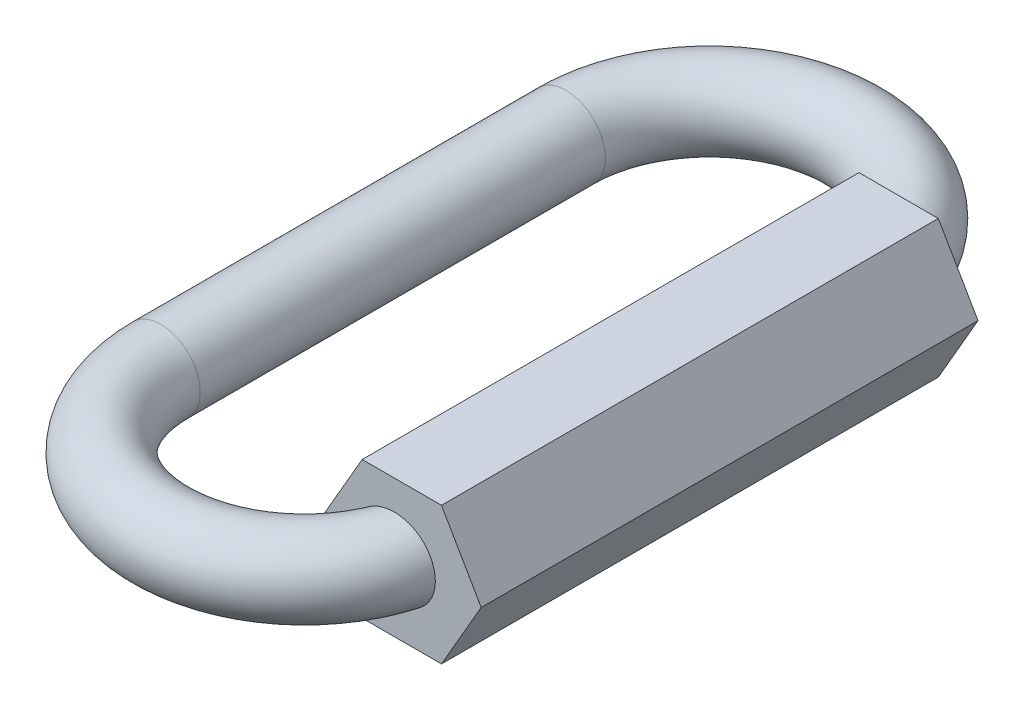
ISO-10303-21;
HEADER;
FILE_DESCRIPTION(('STEP AP214'),'2;1');
FILE_NAME('part.step','',(''),(''),'','','');
FILE_SCHEMA(('AUTOMOTIVE_DESIGN { 1 0 10303 214 1 1 1 1 }'));
ENDSEC;
DATA;
#1=APPLICATION_CONTEXT('core data for automotive mechanical design processes');
#2=APPLICATION_PROTOCOL_DEFINITION('international standard','automotive_design',2000,#1);
#3=PRODUCT_CONTEXT('',#1,'mechanical');
#4=PRODUCT('Part','Part','',(#3));
#5=PRODUCT_RELATED_PRODUCT_CATEGORY('part','',(#4));
#6=PRODUCT_DEFINITION_FORMATION('','',#4);
#7=PRODUCT_DEFINITION_CONTEXT('part definition',#1,'design');
#8=PRODUCT_DEFINITION('design','',#6,#7);
#9=PRODUCT_DEFINITION_SHAPE('','',#8);
#10=(LENGTH_UNIT() NAMED_UNIT(*) SI_UNIT(.MILLI.,.METRE.));
#11=(NAMED_UNIT(*) PLANE_ANGLE_UNIT() SI_UNIT($,.RADIAN.));
#12=(NAMED_UNIT(*) SI_UNIT($,.STERADIAN.) SOLID_ANGLE_UNIT());
#13=UNCERTAINTY_MEASURE_WITH_UNIT(LENGTH_MEASURE(1.E-05),#10,'distance_accuracy_value','');
#14=(GEOMETRIC_REPRESENTATION_CONTEXT(3) GLOBAL_UNCERTAINTY_ASSIGNED_CONTEXT((#13)) GLOBAL_UNIT_ASSIGNED_CONTEXT((#10,
#11,#12)) REPRESENTATION_CONTEXT('',''));
#15=CARTESIAN_POINT('',(0.,0.,0.));
#16=DIRECTION('',(0.,0.,1.));
#17=DIRECTION('',(1.,0.,0.));
#18=AXIS2_PLACEMENT_3D('',#15,#16,#17);
#19=CARTESIAN_POINT('',(0.,0.,-16.));
#20=DIRECTION('',(0.,0.,1.));
#21=DIRECTION('',(1.,0.,0.));
#22=AXIS2_PLACEMENT_3D('',#19,#20,#21);
#23=PLANE('',#22);
#24=DIRECTION('',(-1.,0.,0.));
#25=VECTOR('',#24,1.);
#26=CARTESIAN_POINT('',(2.5547749411641,4.425,-16.));
#27=LINE('',#26,#25);
#28=CARTESIAN_POINT('',(2.5547749411641,4.425,-16.));
#29=VERTEX_POINT('',#28);
#30=CARTESIAN_POINT('',(-2.55477494116409,4.425,-16.));
#31=VERTEX_POINT('',#30);
#32=EDGE_CURVE('E106',#29,#31,#27,.T.);
#33=ORIENTED_EDGE('',*,*,#32,.F.);
#34=DIRECTION('',(-0.5,0.866025403784439,0.));
#35=VECTOR('',#34,1.);
#36=CARTESIAN_POINT('',(5.10954988232819,0.,-16.));
#37=LINE('',#36,#35);
#38=CARTESIAN_POINT('',(5.10954988232819,0.,-16.));
#39=VERTEX_POINT('',#38);
#40=EDGE_CURVE('E111',#39,#29,#37,.T.);
#41=ORIENTED_EDGE('',*,*,#40,.F.);
#42=DIRECTION('',(0.5,0.866025403784439,0.));
#43=VECTOR('',#42,1.);
#44=CARTESIAN_POINT('',(2.55477494116409,-4.425,-16.));
#45=LINE('',#44,#43);
#46=CARTESIAN_POINT('',(2.55477494116409,-4.425,-16.));
#47=VERTEX_POINT('',#46);
#48=EDGE_CURVE('E144',#47,#39,#45,.T.);
#49=ORIENTED_EDGE('',*,*,#48,.F.);
#50=DIRECTION('',(1.,0.,0.));
#51=VECTOR('',#50,1.);
#52=CARTESIAN_POINT('',(-2.5547749411641,-4.425,-16.));
#53=LINE('',#52,#51);
#54=CARTESIAN_POINT('',(-2.5547749411641,-4.425,-16.));
#55=VERTEX_POINT('',#54);
#56=EDGE_CURVE('E141',#55,#47,#53,.T.);
#57=ORIENTED_EDGE('',*,*,#56,.F.);
#58=DIRECTION('',(0.5,-0.866025403784439,0.));
#59=VECTOR('',#58,1.);
#60=CARTESIAN_POINT('',(-5.10954988232819,0.,-16.));
#61=LINE('',#60,#59);
#62=CARTESIAN_POINT('',(-5.10954988232819,0.,-16.));
#63=VERTEX_POINT('',#62);
#64=EDGE_CURVE('E138',#63,#55,#61,.T.);
#65=ORIENTED_EDGE('',*,*,#64,.F.);
#66=DIRECTION('',(-0.5,-0.866025403784439,0.));
#67=VECTOR('',#66,1.);
#68=CARTESIAN_POINT('',(-2.55477494116409,4.425,-16.));
#69=LINE('',#68,#67);
#70=EDGE_CURVE('E136',#31,#63,#69,.T.);
#71=ORIENTED_EDGE('',*,*,#70,.F.);
#72=EDGE_LOOP('',(#33,#41,#49,#57,#65,#71));
#73=FACE_BOUND('',#72,.T.);
#74=CARTESIAN_POINT('',(-3.06900413536494,-0.801609790145161,-16.));
#75=CARTESIAN_POINT('',(-3.01909351343685,-0.936363503355609,-16.));
#76=CARTESIAN_POINT('',(-2.95688127019971,-1.06673171723537,-16.));
#77=CARTESIAN_POINT('',(-2.81090149906449,-1.31498422112775,-16.));
#78=CARTESIAN_POINT('',(-2.72708325250222,-1.4328382030191,-16.));
#79=CARTESIAN_POINT('',(-2.54172024753748,-1.65272885793883,-16.));
#80=CARTESIAN_POINT('',(-2.44025489208379,-1.7548326722037,-16.));
#81=CARTESIAN_POINT('',(-2.22267898122295,-1.9418401468518,-16.));
#82=CARTESIAN_POINT('',(-2.10657342130815,-2.0267496486009,-16.));
#83=CARTESIAN_POINT('',(-1.85451503240919,-2.18305460665647,-16.));
#84=CARTESIAN_POINT('',(-1.71774998530612,-2.25314171050424,-16.));
#85=CARTESIAN_POINT('',(-1.43474640324376,-2.37055087342658,-16.));
#86=CARTESIAN_POINT('',(-1.28850452355718,-2.41786484481509,-16.));
#87=CARTESIAN_POINT('',(-0.983433431555195,-2.49014638260548,-16.));
#88=CARTESIAN_POINT('',(-0.824334720861344,-2.51398373731019,-16.));
#89=CARTESIAN_POINT('',(-0.504376810758348,-2.53446285675912,-16.));
#90=CARTESIAN_POINT('',(-0.343517567407138,-2.53110394114424,-16.));
#91=CARTESIAN_POINT('',(-0.0256618986446927,-2.49690259408987,-16.));
#92=CARTESIAN_POINT('',(0.13135151117211,-2.46621956108199,-16.));
#93=CARTESIAN_POINT('',(0.43762553258376,-2.37790755269611,-16.));
#94=CARTESIAN_POINT('',(0.586887619389329,-2.32028372565304,-16.));
#95=CARTESIAN_POINT('',(0.867448038032218,-2.18190150489549,-16.));
#96=CARTESIAN_POINT('',(0.999206264996456,-2.10207630039365,-16.));
#97=CARTESIAN_POINT('',(1.24662791439162,-1.92047933347772,-16.));
#98=CARTESIAN_POINT('',(1.36229542792527,-1.81871316644663,-16.));
#99=CARTESIAN_POINT('',(1.56884744521657,-1.60097771795354,-16.));
#100=CARTESIAN_POINT('',(1.66059811984797,-1.48582983916977,-16.));
#101=CARTESIAN_POINT('',(1.82260751569294,-1.24129153891539,-16.));
#102=CARTESIAN_POINT('',(1.89287102219418,-1.11190429735538,-16.));
#103=CARTESIAN_POINT('',(2.00735863427976,-0.84758468646424,-16.));
#104=CARTESIAN_POINT('',(2.05242497109594,-0.713016712173273,-16.));
#105=CARTESIAN_POINT('',(2.11878380012589,-0.438143557109762,-16.));
#106=CARTESIAN_POINT('',(2.14007963109195,-0.297839184929372,-16.));
#107=CARTESIAN_POINT('',(2.1579874983122,-0.0186200287027689,-16.));
#108=CARTESIAN_POINT('',(2.15510609574921,0.120262516628913,-16.));
#109=CARTESIAN_POINT('',(2.12596290955776,0.39554573220375,-16.));
#110=CARTESIAN_POINT('',(2.09970230566197,0.531946527323558,-16.));
#111=CARTESIAN_POINT('',(2.02480932622923,0.797869644837646,-16.));
#112=CARTESIAN_POINT('',(1.97626538227519,0.927416919914012,-16.));
#113=CARTESIAN_POINT('',(1.85838271452179,1.17666533177516,-16.));
#114=CARTESIAN_POINT('',(1.78904327357627,1.29636612881634,-16.));
#115=CARTESIAN_POINT('',(1.6306991626606,1.52424289065856,-16.));
#116=CARTESIAN_POINT('',(1.54145374926007,1.63225140846116,-16.));
#117=CARTESIAN_POINT('',(1.34654188050046,1.83224756018794,-16.));
#118=CARTESIAN_POINT('',(1.24087364848552,1.92423345846465,-16.));
#119=CARTESIAN_POINT('',(1.01303904293868,2.09238300156938,-16.));
#120=CARTESIAN_POINT('',(0.890495312656878,2.16803496175709,-16.));
#121=CARTESIAN_POINT('',(0.634819636473529,2.29857405412186,-16.));
#122=CARTESIAN_POINT('',(0.501685896736691,2.35345765925634,-16.));
#123=CARTESIAN_POINT('',(0.223088141399425,2.44321661026248,-16.));
#124=CARTESIAN_POINT('',(0.0773456622172722,2.47722716406105,-16.));
#125=CARTESIAN_POINT('',(-0.217704025009056,2.52138476989456,-16.));
#126=CARTESIAN_POINT('',(-0.367011980050677,2.53152677616294,-16.));
#127=CARTESIAN_POINT('',(-0.671692423394591,2.5280294175261,-16.));
#128=CARTESIAN_POINT('',(-0.827053352685859,2.51336246200072,-16.));
#129=CARTESIAN_POINT('',(-1.1333365329374,2.45896976739161,-16.));
#130=CARTESIAN_POINT('',(-1.2842577896496,2.41923845928562,-16.));
#131=CARTESIAN_POINT('',(-1.58214223485238,2.31425364020075,-16.));
#132=CARTESIAN_POINT('',(-1.72884583971759,2.248261354253,-16.));
#133=CARTESIAN_POINT('',(-2.00905174382948,2.09243263323473,-16.));
#134=CARTESIAN_POINT('',(-2.14255195654584,2.00259243772001,-16.));
#135=CARTESIAN_POINT('',(-2.3910919911656,1.80179932011212,-16.));
#136=CARTESIAN_POINT('',(-2.50625662505924,1.69100146668601,-16.));
#137=CARTESIAN_POINT('',(-2.71477547732237,1.450453264465,-16.));
#138=CARTESIAN_POINT('',(-2.80813970933333,1.32071166184475,-16.));
#139=CARTESIAN_POINT('',(-2.96323209320142,1.05491478733935,-16.));
#140=CARTESIAN_POINT('',(-3.02664523929416,0.919845880975425,-16.));
#141=CARTESIAN_POINT('',(-3.12711357895555,0.640201851585324,-16.));
#142=CARTESIAN_POINT('',(-3.16418352473017,0.495632098674113,-16.));
#143=CARTESIAN_POINT('',(-3.20748446000285,0.216187216321993,-16.));
#144=CARTESIAN_POINT('',(-3.21633204571152,0.0817120028597768,-16.));
#145=CARTESIAN_POINT('',(-3.21011255778352,-0.186539961220946,-16.));
#146=CARTESIAN_POINT('',(-3.19508654709235,-0.320317514928167,-16.));
#147=CARTESIAN_POINT('',(-3.15660511449657,-0.51115434698607,-16.));
#148=CARTESIAN_POINT('',(-3.14224477239156,-0.570183887684114,-16.));
#149=CARTESIAN_POINT('',(-3.10898933939413,-0.686939762221844,-16.));
#150=CARTESIAN_POINT('',(-3.09009508175505,-0.744666333393942,-16.));
#151=CARTESIAN_POINT('',(-3.06900413536494,-0.801609790145161,-16.));
#152=B_SPLINE_CURVE_WITH_KNOTS('',3,(#74,#75,#76,#77,#78,#79,#80,#81,#82,#83,#84,#85,#86,#87,
#88,#89,#90,#91,#92,#93,#94,#95,#96,#97,#98,#99,#100,#101,#102,#103,#104,#105,#106,#107,#108,
#109,#110,#111,#112,#113,#114,#115,#116,#117,#118,#119,#120,#121,#122,#123,#124,#125,#126,#127,
#128,#129,#130,#131,#132,#133,#134,#135,#136,#137,#138,#139,#140,#141,#142,#143,#144,#145,#146,
#147,#148,#149,#150,#151),.UNSPECIFIED.,.T.,.F.,(4,2,2,2,2,2,2,2,2,2,2,2,2,2,2,2,2,2,2,2,2,2,2,
2,2,2,2,2,2,2,2,2,2,2,2,2,2,2,4),(0.,0.430853338357914,0.862727435959984,1.292706349955,
1.72253894268935,2.18154483007291,2.64071360947005,3.12104130673059,3.60138102020994,
4.07893683941416,4.55640143588026,5.0162290663698,5.47593957005606,5.91543380313208,
6.35483008749346,6.7784944538797,7.20209930582224,7.61685131297658,8.03158239260845,
8.44468165172102,8.85779515846704,9.27620550320598,9.69466114402392,10.1247645518853,
10.5549409704853,11.0019118366957,11.4489771832317,11.9150167435328,12.3811598891642,
12.8614660820687,13.3418480568216,13.8188056003493,14.2955436287152,14.740725337393,
15.1856575472032,15.5879195289527,15.989490362729,16.1715913542251,16.353658904383),.UNSPECIFIED.);
#153=CARTESIAN_POINT('',(-3.06900413536494,-0.801609790145161,-16.));
#154=VERTEX_POINT('',#153);
#155=EDGE_CURVE('E11',#154,#154,#152,.T.);
#156=ORIENTED_EDGE('',*,*,#155,.T.);
#157=EDGE_LOOP('',(#156));
#158=FACE_BOUND('',#157,.T.);
#159=ADVANCED_FACE('F43',(#73,#158),#23,.F.);
#160=CARTESIAN_POINT('',(0.,0.,16.));
#161=DIRECTION('',(0.,0.,1.));
#162=DIRECTION('',(1.,0.,0.));
#163=AXIS2_PLACEMENT_3D('',#160,#161,#162);
#164=PLANE('',#163);
#165=DIRECTION('',(-1.,0.,0.));
#166=VECTOR('',#165,1.);
#167=CARTESIAN_POINT('',(2.5547749411641,4.425,16.));
#168=LINE('',#167,#166);
#169=CARTESIAN_POINT('',(2.5547749411641,4.425,16.));
#170=VERTEX_POINT('',#169);
#171=CARTESIAN_POINT('',(-2.55477494116409,4.425,16.));
#172=VERTEX_POINT('',#171);
#173=EDGE_CURVE('E105',#170,#172,#168,.T.);
#174=ORIENTED_EDGE('',*,*,#173,.T.);
#175=DIRECTION('',(-0.5,-0.866025403784439,0.));
#176=VECTOR('',#175,1.);
#177=CARTESIAN_POINT('',(-2.55477494116409,4.425,16.));
#178=LINE('',#177,#176);
#179=CARTESIAN_POINT('',(-5.10954988232819,0.,16.));
#180=VERTEX_POINT('',#179);
#181=EDGE_CURVE('E114',#172,#180,#178,.T.);
#182=ORIENTED_EDGE('',*,*,#181,.T.);
#183=DIRECTION('',(0.5,-0.866025403784439,0.));
#184=VECTOR('',#183,1.);
#185=CARTESIAN_POINT('',(-5.10954988232819,0.,16.));
#186=LINE('',#185,#184);
#187=CARTESIAN_POINT('',(-2.5547749411641,-4.425,16.));
#188=VERTEX_POINT('',#187);
#189=EDGE_CURVE('E119',#180,#188,#186,.T.);
#190=ORIENTED_EDGE('',*,*,#189,.T.);
#191=DIRECTION('',(1.,0.,0.));
#192=VECTOR('',#191,1.);
#193=CARTESIAN_POINT('',(-2.5547749411641,-4.425,16.));
#194=LINE('',#193,#192);
#195=CARTESIAN_POINT('',(2.55477494116409,-4.425,16.));
#196=VERTEX_POINT('',#195);
#197=EDGE_CURVE('E129',#188,#196,#194,.T.);
#198=ORIENTED_EDGE('',*,*,#197,.T.);
#199=DIRECTION('',(0.5,0.866025403784439,0.));
#200=VECTOR('',#199,1.);
#201=CARTESIAN_POINT('',(2.55477494116409,-4.425,16.));
#202=LINE('',#201,#200);
#203=CARTESIAN_POINT('',(5.10954988232819,0.,16.));
#204=VERTEX_POINT('',#203);
#205=EDGE_CURVE('E132',#196,#204,#202,.T.);
#206=ORIENTED_EDGE('',*,*,#205,.T.);
#207=DIRECTION('',(-0.5,0.866025403784439,0.));
#208=VECTOR('',#207,1.);
#209=CARTESIAN_POINT('',(5.10954988232819,0.,16.));
#210=LINE('',#209,#208);
#211=EDGE_CURVE('E125',#204,#170,#210,.T.);
#212=ORIENTED_EDGE('',*,*,#211,.T.);
#213=EDGE_LOOP('',(#174,#182,#190,#198,#206,#212));
#214=FACE_BOUND('',#213,.T.);
#215=CARTESIAN_POINT('',(-3.06900413536494,-0.801609790145162,16.));
#216=CARTESIAN_POINT('',(-3.01909351343685,-0.93636350335561,16.));
#217=CARTESIAN_POINT('',(-2.95688127019971,-1.06673171723538,16.));
#218=CARTESIAN_POINT('',(-2.81090149906449,-1.31498422112775,16.));
#219=CARTESIAN_POINT('',(-2.72708325250222,-1.4328382030191,16.));
#220=CARTESIAN_POINT('',(-2.54172024753748,-1.65272885793883,16.));
#221=CARTESIAN_POINT('',(-2.44025489208379,-1.7548326722037,16.));
#222=CARTESIAN_POINT('',(-2.22267898122295,-1.9418401468518,16.));
#223=CARTESIAN_POINT('',(-2.10657342130815,-2.0267496486009,16.));
#224=CARTESIAN_POINT('',(-1.85451503240918,-2.18305460665647,16.));
#225=CARTESIAN_POINT('',(-1.71774998530612,-2.25314171050424,16.));
#226=CARTESIAN_POINT('',(-1.43474640324376,-2.37055087342658,16.));
#227=CARTESIAN_POINT('',(-1.28850452355717,-2.41786484481509,16.));
#228=CARTESIAN_POINT('',(-0.983433431555192,-2.49014638260548,16.));
#229=CARTESIAN_POINT('',(-0.824334720861341,-2.51398373731019,16.));
#230=CARTESIAN_POINT('',(-0.504376810758345,-2.53446285675912,16.));
#231=CARTESIAN_POINT('',(-0.343517567407135,-2.53110394114424,16.));
#232=CARTESIAN_POINT('',(-0.025661898644689,-2.49690259408987,16.));
#233=CARTESIAN_POINT('',(0.131351511172114,-2.46621956108199,16.));
#234=CARTESIAN_POINT('',(0.437625532583765,-2.37790755269611,16.));
#235=CARTESIAN_POINT('',(0.586887619389335,-2.32028372565303,16.));
#236=CARTESIAN_POINT('',(0.867448038032224,-2.18190150489549,16.));
#237=CARTESIAN_POINT('',(0.999206264996461,-2.10207630039365,16.));
#238=CARTESIAN_POINT('',(1.24662791439162,-1.92047933347772,16.));
#239=CARTESIAN_POINT('',(1.36229542792528,-1.81871316644663,16.));
#240=CARTESIAN_POINT('',(1.56884744521657,-1.60097771795354,16.));
#241=CARTESIAN_POINT('',(1.66059811984797,-1.48582983916978,16.));
#242=CARTESIAN_POINT('',(1.82260751569294,-1.24129153891539,16.));
#243=CARTESIAN_POINT('',(1.89287102219419,-1.11190429735538,16.));
#244=CARTESIAN_POINT('',(2.00735863427976,-0.847584686464245,16.));
#245=CARTESIAN_POINT('',(2.05242497109594,-0.713016712173278,16.));
#246=CARTESIAN_POINT('',(2.1187838001259,-0.438143557109765,16.));
#247=CARTESIAN_POINT('',(2.14007963109196,-0.297839184929375,16.));
#248=CARTESIAN_POINT('',(2.1579874983122,-0.0186200287027712,16.));
#249=CARTESIAN_POINT('',(2.15510609574921,0.120262516628911,16.));
#250=CARTESIAN_POINT('',(2.12596290955776,0.395545732203749,16.));
#251=CARTESIAN_POINT('',(2.09970230566197,0.531946527323557,16.));
#252=CARTESIAN_POINT('',(2.02480932622923,0.797869644837645,16.));
#253=CARTESIAN_POINT('',(1.97626538227519,0.927416919914011,16.));
#254=CARTESIAN_POINT('',(1.85838271452179,1.17666533177516,16.));
#255=CARTESIAN_POINT('',(1.78904327357627,1.29636612881634,16.));
#256=CARTESIAN_POINT('',(1.6306991626606,1.52424289065856,16.));
#257=CARTESIAN_POINT('',(1.54145374926008,1.63225140846116,16.));
#258=CARTESIAN_POINT('',(1.34654188050046,1.83224756018794,16.));
#259=CARTESIAN_POINT('',(1.24087364848552,1.92423345846465,16.));
#260=CARTESIAN_POINT('',(1.01303904293869,2.09238300156938,16.));
#261=CARTESIAN_POINT('',(0.890495312656881,2.16803496175709,16.));
#262=CARTESIAN_POINT('',(0.634819636473531,2.29857405412186,16.));
#263=CARTESIAN_POINT('',(0.501685896736693,2.35345765925634,16.));
#264=CARTESIAN_POINT('',(0.223088141399426,2.44321661026248,16.));
#265=CARTESIAN_POINT('',(0.0773456622172735,2.47722716406105,16.));
#266=CARTESIAN_POINT('',(-0.217704025009054,2.52138476989456,16.));
#267=CARTESIAN_POINT('',(-0.367011980050675,2.53152677616294,16.));
#268=CARTESIAN_POINT('',(-0.671692423394588,2.5280294175261,16.));
#269=CARTESIAN_POINT('',(-0.827053352685857,2.51336246200072,16.));
#270=CARTESIAN_POINT('',(-1.13333653293739,2.45896976739161,16.));
#271=CARTESIAN_POINT('',(-1.28425778964959,2.41923845928562,16.));
#272=CARTESIAN_POINT('',(-1.58214223485237,2.31425364020075,16.));
#273=CARTESIAN_POINT('',(-1.72884583971758,2.248261354253,16.));
#274=CARTESIAN_POINT('',(-2.00905174382948,2.09243263323473,16.));
#275=CARTESIAN_POINT('',(-2.14255195654584,2.00259243772001,16.));
#276=CARTESIAN_POINT('',(-2.3910919911656,1.80179932011212,16.));
#277=CARTESIAN_POINT('',(-2.50625662505924,1.691001466686,16.));
#278=CARTESIAN_POINT('',(-2.71477547732237,1.450453264465,16.));
#279=CARTESIAN_POINT('',(-2.80813970933332,1.32071166184475,16.));
#280=CARTESIAN_POINT('',(-2.96323209320142,1.05491478733935,16.));
#281=CARTESIAN_POINT('',(-3.02664523929415,0.919845880975426,16.));
#282=CARTESIAN_POINT('',(-3.12711357895555,0.640201851585324,16.));
#283=CARTESIAN_POINT('',(-3.16418352473017,0.495632098674114,16.));
#284=CARTESIAN_POINT('',(-3.20748446000284,0.216187216321994,16.));
#285=CARTESIAN_POINT('',(-3.21633204571152,0.0817120028597781,16.));
#286=CARTESIAN_POINT('',(-3.21011255778351,-0.186539961220945,16.));
#287=CARTESIAN_POINT('',(-3.19508654709235,-0.320317514928166,16.));
#288=CARTESIAN_POINT('',(-3.15660511449656,-0.51115434698607,16.));
#289=CARTESIAN_POINT('',(-3.14224477239155,-0.570183887684114,16.));
#290=CARTESIAN_POINT('',(-3.10898933939413,-0.686939762221844,16.));
#291=CARTESIAN_POINT('',(-3.09009508175504,-0.744666333393942,16.));
#292=CARTESIAN_POINT('',(-3.06900413536494,-0.801609790145162,16.));
#293=B_SPLINE_CURVE_WITH_KNOTS('',3,(#215,#216,#217,#218,#219,#220,#221,#222,#223,#224,#225,
#226,#227,#228,#229,#230,#231,#232,#233,#234,#235,#236,#237,#238,#239,#240,#241,#242,#243,#244,
#245,#246,#247,#248,#249,#250,#251,#252,#253,#254,#255,#256,#257,#258,#259,#260,#261,#262,#263,
#264,#265,#266,#267,#268,#269,#270,#271,#272,#273,#274,#275,#276,#277,#278,#279,#280,#281,#282,
#283,#284,#285,#286,#287,#288,#289,#290,#291,#292),.UNSPECIFIED.,.T.,.F.,(4,2,2,2,2,2,2,2,2,2,2,
2,2,2,2,2,2,2,2,2,2,2,2,2,2,2,2,2,2,2,2,2,2,2,2,2,2,2,4),(0.,0.430853338357914,
0.862727435959985,1.29270634995501,1.72253894268935,2.18154483007291,2.64071360947005,
3.12104130673059,3.60138102020994,4.07893683941416,4.55640143588027,5.01622906636981,
5.47593957005606,5.91543380313208,6.35483008749346,6.7784944538797,7.20209930582224,
7.61685131297658,8.03158239260845,8.44468165172103,8.85779515846704,9.27620550320598,
9.69466114402392,10.1247645518853,10.5549409704853,11.0019118366957,11.4489771832317,
11.9150167435328,12.3811598891642,12.8614660820687,13.3418480568216,13.8188056003493,
14.2955436287152,14.740725337393,15.1856575472032,15.5879195289527,15.989490362729,
16.1715913542251,16.353658904383),.UNSPECIFIED.);
#294=CARTESIAN_POINT('',(-3.06900413536494,-0.801609790145162,16.));
#295=VERTEX_POINT('',#294);
#296=EDGE_CURVE('E148',#295,#295,#293,.T.);
#297=ORIENTED_EDGE('',*,*,#296,.F.);
#298=EDGE_LOOP('',(#297));
#299=FACE_BOUND('',#298,.T.);
#300=ADVANCED_FACE('F122',(#214,#299),#164,.T.);
#301=CARTESIAN_POINT('',(2.5547749411641,4.425,-16.));
#302=DIRECTION('',(0.,1.,0.));
#303=DIRECTION('',(0.,0.,1.));
#304=AXIS2_PLACEMENT_3D('',#301,#302,#303);
#305=PLANE('',#304);
#306=DIRECTION('',(0.,0.,1.));
#307=VECTOR('',#306,1.);
#308=CARTESIAN_POINT('',(-2.55477494116409,4.425,-16.));
#309=LINE('',#308,#307);
#310=EDGE_CURVE('E101',#31,#172,#309,.T.);
#311=ORIENTED_EDGE('',*,*,#310,.T.);
#312=ORIENTED_EDGE('',*,*,#173,.F.);
#313=DIRECTION('',(0.,0.,1.));
#314=VECTOR('',#313,1.);
#315=CARTESIAN_POINT('',(2.5547749411641,4.425,-16.));
#316=LINE('',#315,#314);
#317=EDGE_CURVE('E64',#29,#170,#316,.T.);
#318=ORIENTED_EDGE('',*,*,#317,.F.);
#319=ORIENTED_EDGE('',*,*,#32,.T.);
#320=EDGE_LOOP('',(#311,#312,#318,#319));
#321=FACE_BOUND('',#320,.T.);
#322=ADVANCED_FACE('F103',(#321),#305,.T.);
#323=CARTESIAN_POINT('',(5.10954988232819,0.,-16.));
#324=DIRECTION('',(0.866025403784439,0.5,0.));
#325=DIRECTION('',(-0.5,0.866025403784439,0.));
#326=AXIS2_PLACEMENT_3D('',#323,#324,#325);
#327=PLANE('',#326);
#328=ORIENTED_EDGE('',*,*,#317,.T.);
#329=ORIENTED_EDGE('',*,*,#211,.F.);
#330=DIRECTION('',(0.,0.,1.));
#331=VECTOR('',#330,1.);
#332=CARTESIAN_POINT('',(5.10954988232819,0.,-16.));
#333=LINE('',#332,#331);
#334=EDGE_CURVE('E72',#39,#204,#333,.T.);
#335=ORIENTED_EDGE('',*,*,#334,.F.);
#336=ORIENTED_EDGE('',*,*,#40,.T.);
#337=EDGE_LOOP('',(#328,#329,#335,#336));
#338=FACE_BOUND('',#337,.T.);
#339=ADVANCED_FACE('F170',(#338),#327,.T.);
#340=CARTESIAN_POINT('',(2.55477494116409,-4.425,-16.));
#341=DIRECTION('',(0.866025403784439,-0.5,0.));
#342=DIRECTION('',(0.5,0.866025403784439,0.));
#343=AXIS2_PLACEMENT_3D('',#340,#341,#342);
#344=PLANE('',#343);
#345=ORIENTED_EDGE('',*,*,#334,.T.);
#346=ORIENTED_EDGE('',*,*,#205,.F.);
#347=DIRECTION('',(0.,0.,1.));
#348=VECTOR('',#347,1.);
#349=CARTESIAN_POINT('',(2.55477494116409,-4.425,-16.));
#350=LINE('',#349,#348);
#351=EDGE_CURVE('E150',#47,#196,#350,.T.);
#352=ORIENTED_EDGE('',*,*,#351,.F.);
#353=ORIENTED_EDGE('',*,*,#48,.T.);
#354=EDGE_LOOP('',(#345,#346,#352,#353));
#355=FACE_BOUND('',#354,.T.);
#356=ADVANCED_FACE('F173',(#355),#344,.T.);
#357=CARTESIAN_POINT('',(-2.5547749411641,-4.425,-16.));
#358=DIRECTION('',(0.,-1.,0.));
#359=DIRECTION('',(0.,0.,-1.));
#360=AXIS2_PLACEMENT_3D('',#357,#358,#359);
#361=PLANE('',#360);
#362=ORIENTED_EDGE('',*,*,#351,.T.);
#363=ORIENTED_EDGE('',*,*,#197,.F.);
#364=DIRECTION('',(0.,0.,1.));
#365=VECTOR('',#364,1.);
#366=CARTESIAN_POINT('',(-2.5547749411641,-4.425,-16.));
#367=LINE('',#366,#365);
#368=EDGE_CURVE('E152',#55,#188,#367,.T.);
#369=ORIENTED_EDGE('',*,*,#368,.F.);
#370=ORIENTED_EDGE('',*,*,#56,.T.);
#371=EDGE_LOOP('',(#362,#363,#369,#370));
#372=FACE_BOUND('',#371,.T.);
#373=ADVANCED_FACE('F176',(#372),#361,.T.);
#374=CARTESIAN_POINT('',(-5.10954988232819,0.,-16.));
#375=DIRECTION('',(-0.866025403784439,-0.5,0.));
#376=DIRECTION('',(0.5,-0.866025403784439,0.));
#377=AXIS2_PLACEMENT_3D('',#374,#375,#376);
#378=PLANE('',#377);
#379=ORIENTED_EDGE('',*,*,#368,.T.);
#380=ORIENTED_EDGE('',*,*,#189,.F.);
#381=DIRECTION('',(0.,0.,1.));
#382=VECTOR('',#381,1.);
#383=CARTESIAN_POINT('',(-5.10954988232819,0.,-16.));
#384=LINE('',#383,#382);
#385=EDGE_CURVE('E110',#63,#180,#384,.T.);
#386=ORIENTED_EDGE('',*,*,#385,.F.);
#387=ORIENTED_EDGE('',*,*,#64,.T.);
#388=EDGE_LOOP('',(#379,#380,#386,#387));
#389=FACE_BOUND('',#388,.T.);
#390=ADVANCED_FACE('F180',(#389),#378,.T.);
#391=CARTESIAN_POINT('',(-2.55477494116409,4.425,-16.));
#392=DIRECTION('',(-0.866025403784439,0.5,0.));
#393=DIRECTION('',(-0.5,-0.866025403784439,0.));
#394=AXIS2_PLACEMENT_3D('',#391,#392,#393);
#395=PLANE('',#394);
#396=ORIENTED_EDGE('',*,*,#385,.T.);
#397=ORIENTED_EDGE('',*,*,#181,.F.);
#398=ORIENTED_EDGE('',*,*,#310,.F.);
#399=ORIENTED_EDGE('',*,*,#70,.T.);
#400=EDGE_LOOP('',(#396,#397,#398,#399));
#401=FACE_BOUND('',#400,.T.);
#402=ADVANCED_FACE('F115',(#401),#395,.T.);
#403=CARTESIAN_POINT('',(-9.235,0.,-13.05));
#404=DIRECTION('',(0.,1.,0.));
#405=DIRECTION('',(0.,0.,1.));
#406=AXIS2_PLACEMENT_3D('',#403,#404,#405);
#407=TOROIDAL_SURFACE('',#406,9.235,2.53);
#408=CARTESIAN_POINT('',(-18.47,0.,-13.05));
#409=DIRECTION('',(0.,0.,-1.));
#410=DIRECTION('',(-1.,0.,0.));
#411=AXIS2_PLACEMENT_3D('',#408,#409,#410);
#412=CIRCLE('',#411,2.53);
#413=CARTESIAN_POINT('',(-21.,0.,-13.05));
#414=VERTEX_POINT('',#413);
#415=EDGE_CURVE('E155',#414,#414,#412,.T.);
#416=ORIENTED_EDGE('',*,*,#415,.T.);
#417=EDGE_LOOP('',(#416));
#418=FACE_BOUND('',#417,.T.);
#419=ORIENTED_EDGE('',*,*,#155,.F.);
#420=EDGE_LOOP('',(#419));
#421=FACE_BOUND('',#420,.T.);
#422=ADVANCED_FACE('F187',(#418,#421),#407,.T.);
#423=CARTESIAN_POINT('',(-18.47,0.,-13.05));
#424=DIRECTION('',(0.,0.,1.));
#425=DIRECTION('',(1.,0.,0.));
#426=AXIS2_PLACEMENT_3D('',#423,#424,#425);
#427=CYLINDRICAL_SURFACE('',#426,2.53);
#428=CARTESIAN_POINT('',(-18.47,0.,13.05));
#429=DIRECTION('',(0.,0.,-1.));
#430=DIRECTION('',(-1.,0.,0.));
#431=AXIS2_PLACEMENT_3D('',#428,#429,#430);
#432=CIRCLE('',#431,2.53);
#433=CARTESIAN_POINT('',(-21.,0.,13.05));
#434=VERTEX_POINT('',#433);
#435=EDGE_CURVE('E57',#434,#434,#432,.T.);
#436=ORIENTED_EDGE('',*,*,#435,.T.);
#437=EDGE_LOOP('',(#436));
#438=FACE_BOUND('',#437,.T.);
#439=ORIENTED_EDGE('',*,*,#415,.F.);
#440=EDGE_LOOP('',(#439));
#441=FACE_BOUND('',#440,.T.);
#442=ADVANCED_FACE('F191',(#438,#441),#427,.T.);
#443=CARTESIAN_POINT('',(-9.235,0.,13.05));
#444=DIRECTION('',(0.,1.,0.));
#445=DIRECTION('',(0.,0.,1.));
#446=AXIS2_PLACEMENT_3D('',#443,#444,#445);
#447=TOROIDAL_SURFACE('',#446,9.235,2.53);
#448=ORIENTED_EDGE('',*,*,#296,.T.);
#449=EDGE_LOOP('',(#448));
#450=FACE_BOUND('',#449,.T.);
#451=ORIENTED_EDGE('',*,*,#435,.F.);
#452=EDGE_LOOP('',(#451));
#453=FACE_BOUND('',#452,.T.);
#454=ADVANCED_FACE('F45',(#450,#453),#447,.T.);
#455=CLOSED_SHELL('',(#159,#300,#322,#339,#356,#373,#390,#402,#422,#442,#454));
#456=MANIFOLD_SOLID_BREP('B2',#455);
#457=ADVANCED_BREP_SHAPE_REPRESENTATION('',(#18,#456),#14);
#458=SHAPE_DEFINITION_REPRESENTATION(#9,#457);
ENDSEC;
END-ISO-10303-21;
